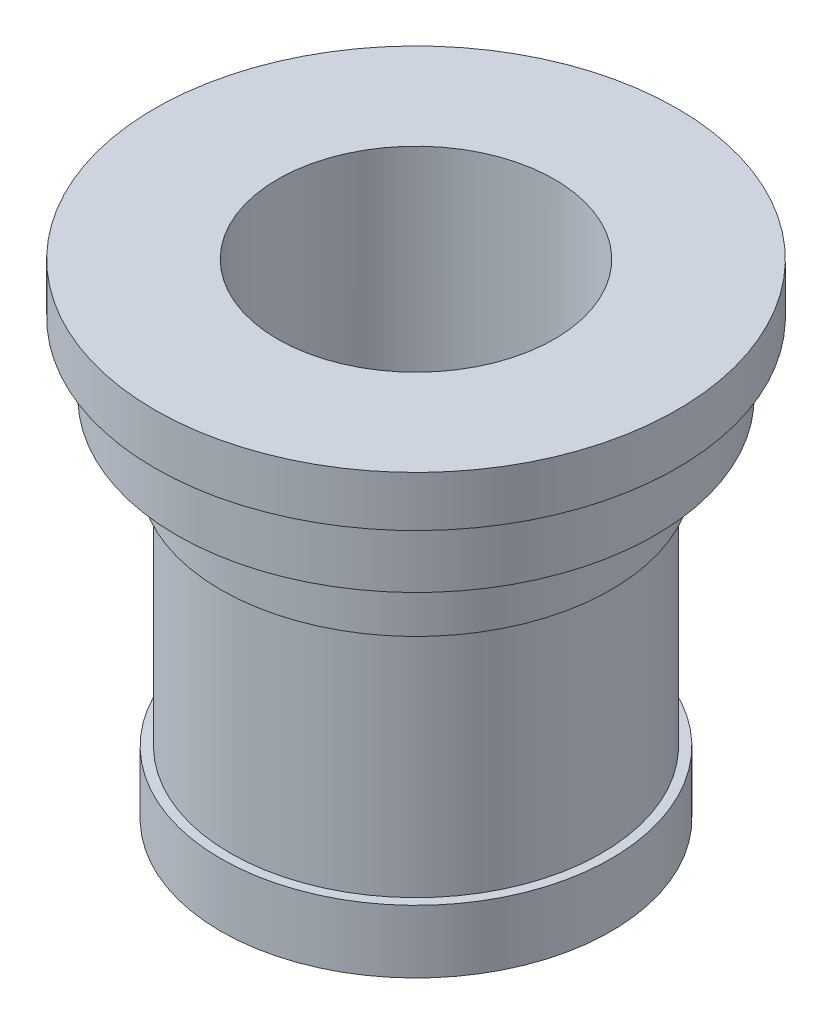
ISO-10303-21;
HEADER;
FILE_DESCRIPTION(('STEP AP214'),'2;1');
FILE_NAME('part.step','',(''),(''),'','','');
FILE_SCHEMA(('AUTOMOTIVE_DESIGN { 1 0 10303 214 1 1 1 1 }'));
ENDSEC;
DATA;
#1=APPLICATION_CONTEXT('core data for automotive mechanical design processes');
#2=APPLICATION_PROTOCOL_DEFINITION('international standard','automotive_design',2000,#1);
#3=PRODUCT_CONTEXT('',#1,'mechanical');
#4=PRODUCT('Part','Part','',(#3));
#5=PRODUCT_RELATED_PRODUCT_CATEGORY('part','',(#4));
#6=PRODUCT_DEFINITION_FORMATION('','',#4);
#7=PRODUCT_DEFINITION_CONTEXT('part definition',#1,'design');
#8=PRODUCT_DEFINITION('design','',#6,#7);
#9=PRODUCT_DEFINITION_SHAPE('','',#8);
#10=(LENGTH_UNIT() NAMED_UNIT(*) SI_UNIT(.MILLI.,.METRE.));
#11=(NAMED_UNIT(*) PLANE_ANGLE_UNIT() SI_UNIT($,.RADIAN.));
#12=(NAMED_UNIT(*) SI_UNIT($,.STERADIAN.) SOLID_ANGLE_UNIT());
#13=UNCERTAINTY_MEASURE_WITH_UNIT(LENGTH_MEASURE(1.E-05),#10,'distance_accuracy_value','');
#14=(GEOMETRIC_REPRESENTATION_CONTEXT(3) GLOBAL_UNCERTAINTY_ASSIGNED_CONTEXT((#13)) GLOBAL_UNIT_ASSIGNED_CONTEXT((#10,
#11,#12)) REPRESENTATION_CONTEXT('',''));
#15=CARTESIAN_POINT('',(0.,0.,0.));
#16=DIRECTION('',(0.,0.,1.));
#17=DIRECTION('',(1.,0.,0.));
#18=AXIS2_PLACEMENT_3D('',#15,#16,#17);
#19=CARTESIAN_POINT('',(0.,108.342465753425,0.));
#20=DIRECTION('',(0.,1.,0.));
#21=DIRECTION('',(0.,0.,1.));
#22=AXIS2_PLACEMENT_3D('',#19,#20,#21);
#23=CYLINDRICAL_SURFACE('',#22,31.);
#24=CARTESIAN_POINT('',(0.,0.,0.));
#25=DIRECTION('',(0.,1.,0.));
#26=DIRECTION('',(0.,0.,1.));
#27=AXIS2_PLACEMENT_3D('',#24,#25,#26);
#28=CIRCLE('',#27,31.);
#29=CARTESIAN_POINT('',(0.,0.,31.));
#30=VERTEX_POINT('',#29);
#31=EDGE_CURVE('E70',#30,#30,#28,.T.);
#32=ORIENTED_EDGE('',*,*,#31,.T.);
#33=EDGE_LOOP('',(#32));
#34=FACE_BOUND('',#33,.T.);
#35=CARTESIAN_POINT('',(0.,9.99999999999999,0.));
#36=DIRECTION('',(0.,1.,0.));
#37=DIRECTION('',(0.,0.,1.));
#38=AXIS2_PLACEMENT_3D('',#35,#36,#37);
#39=CIRCLE('',#38,31.);
#40=CARTESIAN_POINT('',(0.,9.99999999999999,31.));
#41=VERTEX_POINT('',#40);
#42=EDGE_CURVE('E103',#41,#41,#39,.T.);
#43=ORIENTED_EDGE('',*,*,#42,.F.);
#44=EDGE_LOOP('',(#43));
#45=FACE_BOUND('',#44,.T.);
#46=ADVANCED_FACE('F33',(#34,#45),#23,.T.);
#47=CARTESIAN_POINT('',(-31.,10.,0.));
#48=DIRECTION('',(0.,1.,0.));
#49=DIRECTION('',(0.,0.,1.));
#50=AXIS2_PLACEMENT_3D('',#47,#48,#49);
#51=PLANE('',#50);
#52=ORIENTED_EDGE('',*,*,#42,.T.);
#53=EDGE_LOOP('',(#52));
#54=FACE_BOUND('',#53,.T.);
#55=CARTESIAN_POINT('',(0.,9.99999999999999,0.));
#56=DIRECTION('',(0.,1.,0.));
#57=DIRECTION('',(0.,0.,1.));
#58=AXIS2_PLACEMENT_3D('',#55,#56,#57);
#59=CIRCLE('',#58,29.5);
#60=CARTESIAN_POINT('',(0.,9.99999999999999,29.5));
#61=VERTEX_POINT('',#60);
#62=EDGE_CURVE('E100',#61,#61,#59,.T.);
#63=ORIENTED_EDGE('',*,*,#62,.F.);
#64=EDGE_LOOP('',(#63));
#65=FACE_BOUND('',#64,.T.);
#66=ADVANCED_FACE('F107',(#54,#65),#51,.T.);
#67=CARTESIAN_POINT('',(0.,108.342465753425,0.));
#68=DIRECTION('',(0.,1.,0.));
#69=DIRECTION('',(0.,0.,1.));
#70=AXIS2_PLACEMENT_3D('',#67,#68,#69);
#71=CYLINDRICAL_SURFACE('',#70,29.5);
#72=ORIENTED_EDGE('',*,*,#62,.T.);
#73=EDGE_LOOP('',(#72));
#74=FACE_BOUND('',#73,.T.);
#75=CARTESIAN_POINT('',(0.,47.,0.));
#76=DIRECTION('',(0.,1.,0.));
#77=DIRECTION('',(0.,0.,1.));
#78=AXIS2_PLACEMENT_3D('',#75,#76,#77);
#79=CIRCLE('',#78,29.5);
#80=CARTESIAN_POINT('',(0.,47.,29.5));
#81=VERTEX_POINT('',#80);
#82=EDGE_CURVE('E97',#81,#81,#79,.T.);
#83=ORIENTED_EDGE('',*,*,#82,.F.);
#84=EDGE_LOOP('',(#83));
#85=FACE_BOUND('',#84,.T.);
#86=ADVANCED_FACE('F115',(#74,#85),#71,.T.);
#87=CARTESIAN_POINT('',(-29.5,47.,0.));
#88=DIRECTION('',(0.,-1.,0.));
#89=DIRECTION('',(0.,0.,-1.));
#90=AXIS2_PLACEMENT_3D('',#87,#88,#89);
#91=PLANE('',#90);
#92=ORIENTED_EDGE('',*,*,#82,.T.);
#93=EDGE_LOOP('',(#92));
#94=FACE_BOUND('',#93,.T.);
#95=CARTESIAN_POINT('',(0.,47.,0.));
#96=DIRECTION('',(0.,1.,0.));
#97=DIRECTION('',(0.,0.,1.));
#98=AXIS2_PLACEMENT_3D('',#95,#96,#97);
#99=CIRCLE('',#98,31.);
#100=CARTESIAN_POINT('',(0.,47.,31.));
#101=VERTEX_POINT('',#100);
#102=EDGE_CURVE('E94',#101,#101,#99,.T.);
#103=ORIENTED_EDGE('',*,*,#102,.F.);
#104=EDGE_LOOP('',(#103));
#105=FACE_BOUND('',#104,.T.);
#106=ADVANCED_FACE('F153',(#94,#105),#91,.T.);
#107=CARTESIAN_POINT('',(0.,108.342465753425,0.));
#108=DIRECTION('',(0.,1.,0.));
#109=DIRECTION('',(0.,0.,1.));
#110=AXIS2_PLACEMENT_3D('',#107,#108,#109);
#111=CYLINDRICAL_SURFACE('',#110,31.);
#112=ORIENTED_EDGE('',*,*,#102,.T.);
#113=EDGE_LOOP('',(#112));
#114=FACE_BOUND('',#113,.T.);
#115=CARTESIAN_POINT('',(0.,58.,0.));
#116=DIRECTION('',(0.,1.,0.));
#117=DIRECTION('',(0.,0.,1.));
#118=AXIS2_PLACEMENT_3D('',#115,#116,#117);
#119=CIRCLE('',#118,31.);
#120=CARTESIAN_POINT('',(0.,58.,31.));
#121=VERTEX_POINT('',#120);
#122=EDGE_CURVE('E91',#121,#121,#119,.T.);
#123=ORIENTED_EDGE('',*,*,#122,.F.);
#124=EDGE_LOOP('',(#123));
#125=FACE_BOUND('',#124,.T.);
#126=ADVANCED_FACE('F149',(#114,#125),#111,.T.);
#127=CARTESIAN_POINT('',(-31.,58.,0.));
#128=DIRECTION('',(0.,-1.,0.));
#129=DIRECTION('',(0.,0.,-1.));
#130=AXIS2_PLACEMENT_3D('',#127,#128,#129);
#131=PLANE('',#130);
#132=ORIENTED_EDGE('',*,*,#122,.T.);
#133=EDGE_LOOP('',(#132));
#134=FACE_BOUND('',#133,.T.);
#135=CARTESIAN_POINT('',(0.,58.,0.));
#136=DIRECTION('',(0.,1.,0.));
#137=DIRECTION('',(0.,0.,1.));
#138=AXIS2_PLACEMENT_3D('',#135,#136,#137);
#139=CIRCLE('',#138,38.);
#140=CARTESIAN_POINT('',(0.,58.,38.));
#141=VERTEX_POINT('',#140);
#142=EDGE_CURVE('E88',#141,#141,#139,.T.);
#143=ORIENTED_EDGE('',*,*,#142,.F.);
#144=EDGE_LOOP('',(#143));
#145=FACE_BOUND('',#144,.T.);
#146=ADVANCED_FACE('F145',(#134,#145),#131,.T.);
#147=CARTESIAN_POINT('',(0.,108.342465753425,0.));
#148=DIRECTION('',(0.,1.,0.));
#149=DIRECTION('',(0.,0.,1.));
#150=AXIS2_PLACEMENT_3D('',#147,#148,#149);
#151=CYLINDRICAL_SURFACE('',#150,38.);
#152=ORIENTED_EDGE('',*,*,#142,.T.);
#153=EDGE_LOOP('',(#152));
#154=FACE_BOUND('',#153,.T.);
#155=CARTESIAN_POINT('',(0.,69.,0.));
#156=DIRECTION('',(0.,1.,0.));
#157=DIRECTION('',(0.,0.,1.));
#158=AXIS2_PLACEMENT_3D('',#155,#156,#157);
#159=CIRCLE('',#158,38.);
#160=CARTESIAN_POINT('',(0.,69.,38.));
#161=VERTEX_POINT('',#160);
#162=EDGE_CURVE('E85',#161,#161,#159,.T.);
#163=ORIENTED_EDGE('',*,*,#162,.F.);
#164=EDGE_LOOP('',(#163));
#165=FACE_BOUND('',#164,.T.);
#166=ADVANCED_FACE('F141',(#154,#165),#151,.T.);
#167=CARTESIAN_POINT('',(-38.,69.,0.));
#168=DIRECTION('',(0.,-1.,0.));
#169=DIRECTION('',(0.,0.,-1.));
#170=AXIS2_PLACEMENT_3D('',#167,#168,#169);
#171=PLANE('',#170);
#172=ORIENTED_EDGE('',*,*,#162,.T.);
#173=EDGE_LOOP('',(#172));
#174=FACE_BOUND('',#173,.T.);
#175=CARTESIAN_POINT('',(0.,69.,0.));
#176=DIRECTION('',(0.,1.,0.));
#177=DIRECTION('',(0.,0.,1.));
#178=AXIS2_PLACEMENT_3D('',#175,#176,#177);
#179=CIRCLE('',#178,41.5);
#180=CARTESIAN_POINT('',(0.,69.,41.5));
#181=VERTEX_POINT('',#180);
#182=EDGE_CURVE('E82',#181,#181,#179,.T.);
#183=ORIENTED_EDGE('',*,*,#182,.F.);
#184=EDGE_LOOP('',(#183));
#185=FACE_BOUND('',#184,.T.);
#186=ADVANCED_FACE('F137',(#174,#185),#171,.T.);
#187=CARTESIAN_POINT('',(0.,108.342465753425,0.));
#188=DIRECTION('',(0.,1.,0.));
#189=DIRECTION('',(0.,0.,1.));
#190=AXIS2_PLACEMENT_3D('',#187,#188,#189);
#191=CYLINDRICAL_SURFACE('',#190,41.5);
#192=ORIENTED_EDGE('',*,*,#182,.T.);
#193=EDGE_LOOP('',(#192));
#194=FACE_BOUND('',#193,.T.);
#195=CARTESIAN_POINT('',(0.,77.,0.));
#196=DIRECTION('',(0.,1.,0.));
#197=DIRECTION('',(0.,0.,1.));
#198=AXIS2_PLACEMENT_3D('',#195,#196,#197);
#199=CIRCLE('',#198,41.5);
#200=CARTESIAN_POINT('',(0.,77.,41.5));
#201=VERTEX_POINT('',#200);
#202=EDGE_CURVE('E79',#201,#201,#199,.T.);
#203=ORIENTED_EDGE('',*,*,#202,.F.);
#204=EDGE_LOOP('',(#203));
#205=FACE_BOUND('',#204,.T.);
#206=ADVANCED_FACE('F133',(#194,#205),#191,.T.);
#207=CARTESIAN_POINT('',(-41.5,77.,0.));
#208=DIRECTION('',(0.,1.,0.));
#209=DIRECTION('',(0.,0.,1.));
#210=AXIS2_PLACEMENT_3D('',#207,#208,#209);
#211=PLANE('',#210);
#212=ORIENTED_EDGE('',*,*,#202,.T.);
#213=EDGE_LOOP('',(#212));
#214=FACE_BOUND('',#213,.T.);
#215=CARTESIAN_POINT('',(0.,77.,0.));
#216=DIRECTION('',(0.,1.,0.));
#217=DIRECTION('',(0.,0.,1.));
#218=AXIS2_PLACEMENT_3D('',#215,#216,#217);
#219=CIRCLE('',#218,22.);
#220=CARTESIAN_POINT('',(0.,77.,22.));
#221=VERTEX_POINT('',#220);
#222=EDGE_CURVE('E76',#221,#221,#219,.T.);
#223=ORIENTED_EDGE('',*,*,#222,.F.);
#224=EDGE_LOOP('',(#223));
#225=FACE_BOUND('',#224,.T.);
#226=ADVANCED_FACE('F127',(#214,#225),#211,.T.);
#227=CARTESIAN_POINT('',(0.,108.342465753425,0.));
#228=DIRECTION('',(0.,1.,0.));
#229=DIRECTION('',(0.,0.,1.));
#230=AXIS2_PLACEMENT_3D('',#227,#228,#229);
#231=CYLINDRICAL_SURFACE('',#230,22.);
#232=DIRECTION('',(0.,-1.,0.));
#233=VECTOR('',#232,1.);
#234=CARTESIAN_POINT('',(-21.9488636363636,2.5,1.49912810403716));
#235=LINE('',#234,#233);
#236=CARTESIAN_POINT('',(-21.9488636363636,5.,1.49912810403716));
#237=VERTEX_POINT('',#236);
#238=CARTESIAN_POINT('',(-21.9488636363636,0.,1.49912810403717));
#239=VERTEX_POINT('',#238);
#240=EDGE_CURVE('E47',#237,#239,#235,.T.);
#241=ORIENTED_EDGE('',*,*,#240,.F.);
#242=CARTESIAN_POINT('',(0.,5.,0.));
#243=DIRECTION('',(0.,-1.,0.));
#244=DIRECTION('',(0.,0.,-1.));
#245=AXIS2_PLACEMENT_3D('',#242,#243,#244);
#246=CIRCLE('',#245,22.);
#247=CARTESIAN_POINT('',(-21.9488636363636,5.,-1.49912810403716));
#248=VERTEX_POINT('',#247);
#249=EDGE_CURVE('E11',#237,#248,#246,.T.);
#250=ORIENTED_EDGE('',*,*,#249,.T.);
#251=DIRECTION('',(0.,-1.,0.));
#252=VECTOR('',#251,1.);
#253=CARTESIAN_POINT('',(-21.9488636363636,2.5,-1.49912810403716));
#254=LINE('',#253,#252);
#255=CARTESIAN_POINT('',(-21.9488636363636,0.,-1.49912810403716));
#256=VERTEX_POINT('',#255);
#257=EDGE_CURVE('E56',#256,#248,#254,.F.);
#258=ORIENTED_EDGE('',*,*,#257,.F.);
#259=CARTESIAN_POINT('',(0.,0.,0.));
#260=DIRECTION('',(0.,1.,0.));
#261=DIRECTION('',(0.,0.,1.));
#262=AXIS2_PLACEMENT_3D('',#259,#260,#261);
#263=CIRCLE('',#262,22.);
#264=EDGE_CURVE('E69',#239,#256,#263,.T.);
#265=ORIENTED_EDGE('',*,*,#264,.F.);
#266=EDGE_LOOP('',(#241,#250,#258,#265));
#267=FACE_BOUND('',#266,.T.);
#268=ORIENTED_EDGE('',*,*,#222,.T.);
#269=EDGE_LOOP('',(#268));
#270=FACE_BOUND('',#269,.T.);
#271=ADVANCED_FACE('F67',(#267,#270),#231,.F.);
#272=CARTESIAN_POINT('',(-22.,0.,0.));
#273=DIRECTION('',(0.,-1.,0.));
#274=DIRECTION('',(0.,0.,-1.));
#275=AXIS2_PLACEMENT_3D('',#272,#273,#274);
#276=PLANE('',#275);
#277=CARTESIAN_POINT('',(-22.,0.,0.));
#278=DIRECTION('',(0.,-1.,0.));
#279=DIRECTION('',(0.,0.,-1.));
#280=AXIS2_PLACEMENT_3D('',#277,#278,#279);
#281=CIRCLE('',#280,1.5);
#282=EDGE_CURVE('E40',#239,#256,#281,.T.);
#283=ORIENTED_EDGE('',*,*,#282,.F.);
#284=ORIENTED_EDGE('',*,*,#264,.T.);
#285=EDGE_LOOP('',(#283,#284));
#286=FACE_BOUND('',#285,.T.);
#287=ORIENTED_EDGE('',*,*,#31,.F.);
#288=EDGE_LOOP('',(#287));
#289=FACE_BOUND('',#288,.T.);
#290=ADVANCED_FACE('F118',(#286,#289),#276,.T.);
#291=CARTESIAN_POINT('',(-22.,5.,0.));
#292=DIRECTION('',(0.,-1.,0.));
#293=DIRECTION('',(0.,0.,-1.));
#294=AXIS2_PLACEMENT_3D('',#291,#292,#293);
#295=CYLINDRICAL_SURFACE('',#294,1.5);
#296=ORIENTED_EDGE('',*,*,#240,.T.);
#297=ORIENTED_EDGE('',*,*,#282,.T.);
#298=ORIENTED_EDGE('',*,*,#257,.T.);
#299=CARTESIAN_POINT('',(-22.,5.,0.));
#300=DIRECTION('',(0.,-1.,0.));
#301=DIRECTION('',(0.,0.,-1.));
#302=AXIS2_PLACEMENT_3D('',#299,#300,#301);
#303=CIRCLE('',#302,1.5);
#304=EDGE_CURVE('E59',#237,#248,#303,.T.);
#305=ORIENTED_EDGE('',*,*,#304,.F.);
#306=EDGE_LOOP('',(#296,#297,#298,#305));
#307=FACE_BOUND('',#306,.T.);
#308=ADVANCED_FACE('F58',(#307),#295,.F.);
#309=CARTESIAN_POINT('',(-22.,5.,0.));
#310=DIRECTION('',(0.,-1.,0.));
#311=DIRECTION('',(0.,0.,-1.));
#312=AXIS2_PLACEMENT_3D('',#309,#310,#311);
#313=PLANE('',#312);
#314=ORIENTED_EDGE('',*,*,#304,.T.);
#315=ORIENTED_EDGE('',*,*,#249,.F.);
#316=EDGE_LOOP('',(#314,#315));
#317=FACE_BOUND('',#316,.T.);
#318=ADVANCED_FACE('F65',(#317),#313,.T.);
#319=CLOSED_SHELL('',(#46,#66,#86,#106,#126,#146,#166,#186,#206,#226,#271,#290,#308,#318));
#320=MANIFOLD_SOLID_BREP('B2',#319);
#321=ADVANCED_BREP_SHAPE_REPRESENTATION('',(#18,#320),#14);
#322=SHAPE_DEFINITION_REPRESENTATION(#9,#321);
ENDSEC;
END-ISO-10303-21;
